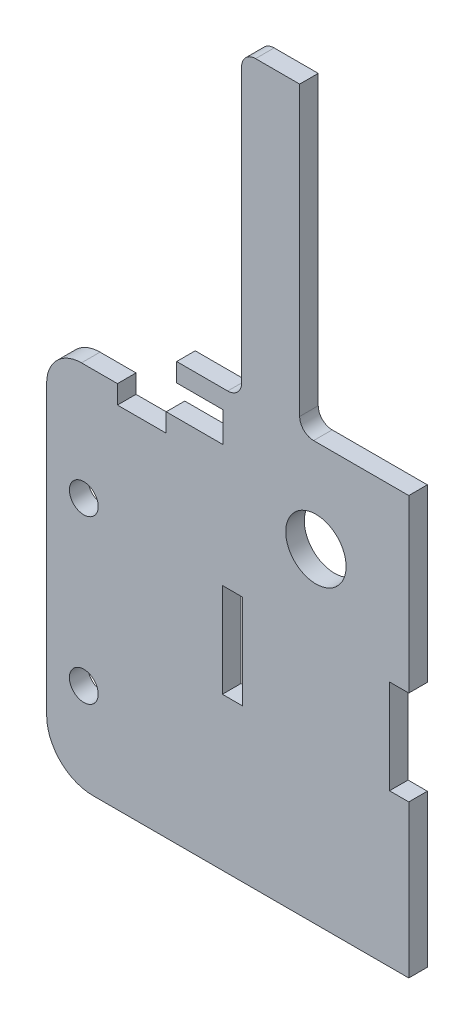
ISO-10303-21;
HEADER;
FILE_DESCRIPTION(('STEP AP214'),'2;1');
FILE_NAME('part.step','',(''),(''),'','','');
FILE_SCHEMA(('AUTOMOTIVE_DESIGN { 1 0 10303 214 1 1 1 1 }'));
ENDSEC;
DATA;
#1=APPLICATION_CONTEXT('core data for automotive mechanical design processes');
#2=APPLICATION_PROTOCOL_DEFINITION('international standard','automotive_design',2000,#1);
#3=PRODUCT_CONTEXT('',#1,'mechanical');
#4=PRODUCT('Part','Part','',(#3));
#5=PRODUCT_RELATED_PRODUCT_CATEGORY('part','',(#4));
#6=PRODUCT_DEFINITION_FORMATION('','',#4);
#7=PRODUCT_DEFINITION_CONTEXT('part definition',#1,'design');
#8=PRODUCT_DEFINITION('design','',#6,#7);
#9=PRODUCT_DEFINITION_SHAPE('','',#8);
#10=(LENGTH_UNIT() NAMED_UNIT(*) SI_UNIT(.MILLI.,.METRE.));
#11=(NAMED_UNIT(*) PLANE_ANGLE_UNIT() SI_UNIT($,.RADIAN.));
#12=(NAMED_UNIT(*) SI_UNIT($,.STERADIAN.) SOLID_ANGLE_UNIT());
#13=UNCERTAINTY_MEASURE_WITH_UNIT(LENGTH_MEASURE(1.E-05),#10,'distance_accuracy_value','');
#14=(GEOMETRIC_REPRESENTATION_CONTEXT(3) GLOBAL_UNCERTAINTY_ASSIGNED_CONTEXT((#13)) GLOBAL_UNIT_ASSIGNED_CONTEXT((#10,
#11,#12)) REPRESENTATION_CONTEXT('',''));
#15=CARTESIAN_POINT('',(0.,0.,0.));
#16=DIRECTION('',(0.,0.,1.));
#17=DIRECTION('',(1.,0.,0.));
#18=AXIS2_PLACEMENT_3D('',#15,#16,#17);
#19=CARTESIAN_POINT('',(3.99999999999999,4.5,40.));
#20=DIRECTION('',(-1.,0.,0.));
#21=DIRECTION('',(0.,-1.,0.));
#22=AXIS2_PLACEMENT_3D('',#19,#20,#21);
#23=PLANE('',#22);
#24=DIRECTION('',(0.,0.,1.));
#25=VECTOR('',#24,1.);
#26=CARTESIAN_POINT('',(3.99999999999999,66.5,40.));
#27=LINE('',#26,#25);
#28=CARTESIAN_POINT('',(3.99999999999999,66.5,36.));
#29=VERTEX_POINT('',#28);
#30=CARTESIAN_POINT('',(3.99999999999999,66.5,40.));
#31=VERTEX_POINT('',#30);
#32=EDGE_CURVE('E11',#29,#31,#27,.T.);
#33=ORIENTED_EDGE('',*,*,#32,.F.);
#34=DIRECTION('',(0.,1.,0.));
#35=VECTOR('',#34,1.);
#36=CARTESIAN_POINT('',(3.99999999999999,0.,36.));
#37=LINE('',#36,#35);
#38=CARTESIAN_POINT('',(3.99999999999999,7.5,36.));
#39=VERTEX_POINT('',#38);
#40=EDGE_CURVE('E178',#29,#39,#37,.F.);
#41=ORIENTED_EDGE('',*,*,#40,.T.);
#42=DIRECTION('',(0.,0.,1.));
#43=VECTOR('',#42,1.);
#44=CARTESIAN_POINT('',(3.99999999999999,7.5,40.));
#45=LINE('',#44,#43);
#46=CARTESIAN_POINT('',(3.99999999999999,7.5,40.));
#47=VERTEX_POINT('',#46);
#48=EDGE_CURVE('E55',#39,#47,#45,.T.);
#49=ORIENTED_EDGE('',*,*,#48,.T.);
#50=DIRECTION('',(0.,-1.,0.));
#51=VECTOR('',#50,1.);
#52=CARTESIAN_POINT('',(3.99999999999999,4.5,40.));
#53=LINE('',#52,#51);
#54=EDGE_CURVE('E371',#31,#47,#53,.T.);
#55=ORIENTED_EDGE('',*,*,#54,.F.);
#56=EDGE_LOOP('',(#33,#41,#49,#55));
#57=FACE_BOUND('',#56,.T.);
#58=ADVANCED_FACE('F45',(#57),#23,.T.);
#59=CARTESIAN_POINT('',(0.99999999999999,7.5,40.));
#60=DIRECTION('',(0.,0.,1.));
#61=DIRECTION('',(1.,0.,0.));
#62=AXIS2_PLACEMENT_3D('',#59,#60,#61);
#63=CYLINDRICAL_SURFACE('',#62,3.);
#64=ORIENTED_EDGE('',*,*,#48,.F.);
#65=CARTESIAN_POINT('',(0.99999999999999,7.5,36.));
#66=DIRECTION('',(0.,0.,1.));
#67=DIRECTION('',(1.,0.,0.));
#68=AXIS2_PLACEMENT_3D('',#65,#66,#67);
#69=CIRCLE('',#68,3.);
#70=CARTESIAN_POINT('',(0.99999999999999,4.5,36.));
#71=VERTEX_POINT('',#70);
#72=EDGE_CURVE('E278',#39,#71,#69,.F.);
#73=ORIENTED_EDGE('',*,*,#72,.T.);
#74=DIRECTION('',(0.,0.,1.));
#75=VECTOR('',#74,1.);
#76=CARTESIAN_POINT('',(0.99999999999999,4.5,40.));
#77=LINE('',#76,#75);
#78=CARTESIAN_POINT('',(0.99999999999999,4.5,40.));
#79=VERTEX_POINT('',#78);
#80=EDGE_CURVE('E364',#71,#79,#77,.T.);
#81=ORIENTED_EDGE('',*,*,#80,.T.);
#82=CARTESIAN_POINT('',(0.99999999999999,7.5,40.));
#83=DIRECTION('',(0.,0.,1.));
#84=DIRECTION('',(1.,0.,0.));
#85=AXIS2_PLACEMENT_3D('',#82,#83,#84);
#86=CIRCLE('',#85,3.);
#87=EDGE_CURVE('E381',#47,#79,#86,.F.);
#88=ORIENTED_EDGE('',*,*,#87,.F.);
#89=EDGE_LOOP('',(#64,#73,#81,#88));
#90=FACE_BOUND('',#89,.T.);
#91=ADVANCED_FACE('F385',(#90),#63,.F.);
#92=CARTESIAN_POINT('',(0.,4.5,40.));
#93=DIRECTION('',(0.,-1.,0.));
#94=DIRECTION('',(1.,0.,0.));
#95=AXIS2_PLACEMENT_3D('',#92,#93,#94);
#96=PLANE('',#95);
#97=ORIENTED_EDGE('',*,*,#80,.F.);
#98=DIRECTION('',(1.,0.,0.));
#99=VECTOR('',#98,1.);
#100=CARTESIAN_POINT('',(0.,4.5,36.));
#101=LINE('',#100,#99);
#102=CARTESIAN_POINT('',(-10.,4.5,36.));
#103=VERTEX_POINT('',#102);
#104=EDGE_CURVE('E274',#103,#71,#101,.T.);
#105=ORIENTED_EDGE('',*,*,#104,.F.);
#106=DIRECTION('',(0.,0.,1.));
#107=VECTOR('',#106,1.);
#108=CARTESIAN_POINT('',(-10.,4.5,40.));
#109=LINE('',#108,#107);
#110=CARTESIAN_POINT('',(-10.,4.5,40.));
#111=VERTEX_POINT('',#110);
#112=EDGE_CURVE('E361',#103,#111,#109,.T.);
#113=ORIENTED_EDGE('',*,*,#112,.T.);
#114=DIRECTION('',(1.,0.,0.));
#115=VECTOR('',#114,1.);
#116=CARTESIAN_POINT('',(0.,4.5,40.));
#117=LINE('',#116,#115);
#118=EDGE_CURVE('E387',#111,#79,#117,.T.);
#119=ORIENTED_EDGE('',*,*,#118,.T.);
#120=EDGE_LOOP('',(#97,#105,#113,#119));
#121=FACE_BOUND('',#120,.T.);
#122=ADVANCED_FACE('F608',(#121),#96,.F.);
#123=CARTESIAN_POINT('',(-10.,0.,40.));
#124=DIRECTION('',(1.,0.,0.));
#125=DIRECTION('',(0.,1.,0.));
#126=AXIS2_PLACEMENT_3D('',#123,#124,#125);
#127=PLANE('',#126);
#128=ORIENTED_EDGE('',*,*,#112,.F.);
#129=DIRECTION('',(0.,1.,0.));
#130=VECTOR('',#129,1.);
#131=CARTESIAN_POINT('',(-10.,0.,36.));
#132=LINE('',#131,#130);
#133=CARTESIAN_POINT('',(-10.,0.499999999999999,36.));
#134=VERTEX_POINT('',#133);
#135=EDGE_CURVE('E270',#134,#103,#132,.T.);
#136=ORIENTED_EDGE('',*,*,#135,.F.);
#137=DIRECTION('',(0.,0.,1.));
#138=VECTOR('',#137,1.);
#139=CARTESIAN_POINT('',(-10.,0.499999999999999,40.));
#140=LINE('',#139,#138);
#141=CARTESIAN_POINT('',(-10.,0.499999999999999,40.));
#142=VERTEX_POINT('',#141);
#143=EDGE_CURVE('E358',#134,#142,#140,.T.);
#144=ORIENTED_EDGE('',*,*,#143,.T.);
#145=DIRECTION('',(0.,1.,0.));
#146=VECTOR('',#145,1.);
#147=CARTESIAN_POINT('',(-10.,0.,40.));
#148=LINE('',#147,#146);
#149=EDGE_CURVE('E391',#142,#111,#148,.T.);
#150=ORIENTED_EDGE('',*,*,#149,.T.);
#151=EDGE_LOOP('',(#128,#136,#144,#150));
#152=FACE_BOUND('',#151,.T.);
#153=ADVANCED_FACE('F704',(#152),#127,.F.);
#154=CARTESIAN_POINT('',(0.,0.499999999999999,40.));
#155=DIRECTION('',(0.,-1.,0.));
#156=DIRECTION('',(1.,0.,0.));
#157=AXIS2_PLACEMENT_3D('',#154,#155,#156);
#158=PLANE('',#157);
#159=ORIENTED_EDGE('',*,*,#143,.F.);
#160=DIRECTION('',(1.,0.,0.));
#161=VECTOR('',#160,1.);
#162=CARTESIAN_POINT('',(0.,0.499999999999999,36.));
#163=LINE('',#162,#161);
#164=CARTESIAN_POINT('',(0.,0.499999999999999,36.));
#165=VERTEX_POINT('',#164);
#166=EDGE_CURVE('E266',#134,#165,#163,.T.);
#167=ORIENTED_EDGE('',*,*,#166,.T.);
#168=DIRECTION('',(0.,0.,1.));
#169=VECTOR('',#168,1.);
#170=CARTESIAN_POINT('',(0.,0.499999999999999,40.));
#171=LINE('',#170,#169);
#172=CARTESIAN_POINT('',(0.,0.499999999999999,40.));
#173=VERTEX_POINT('',#172);
#174=EDGE_CURVE('E355',#165,#173,#171,.T.);
#175=ORIENTED_EDGE('',*,*,#174,.T.);
#176=DIRECTION('',(1.,0.,0.));
#177=VECTOR('',#176,1.);
#178=CARTESIAN_POINT('',(0.,0.499999999999999,40.));
#179=LINE('',#178,#177);
#180=EDGE_CURVE('E399',#142,#173,#179,.T.);
#181=ORIENTED_EDGE('',*,*,#180,.F.);
#182=EDGE_LOOP('',(#159,#167,#175,#181));
#183=FACE_BOUND('',#182,.T.);
#184=ADVANCED_FACE('F715',(#183),#158,.T.);
#185=CARTESIAN_POINT('',(0.,0.,40.));
#186=DIRECTION('',(-1.,0.,0.));
#187=DIRECTION('',(0.,-1.,0.));
#188=AXIS2_PLACEMENT_3D('',#185,#186,#187);
#189=PLANE('',#188);
#190=ORIENTED_EDGE('',*,*,#174,.F.);
#191=DIRECTION('',(0.,1.,0.));
#192=VECTOR('',#191,1.);
#193=CARTESIAN_POINT('',(0.,0.,36.));
#194=LINE('',#193,#192);
#195=CARTESIAN_POINT('',(0.,-6.00000000000001,36.));
#196=VERTEX_POINT('',#195);
#197=EDGE_CURVE('E262',#165,#196,#194,.F.);
#198=ORIENTED_EDGE('',*,*,#197,.T.);
#199=DIRECTION('',(0.,0.,1.));
#200=VECTOR('',#199,1.);
#201=CARTESIAN_POINT('',(0.,-6.00000000000001,40.));
#202=LINE('',#201,#200);
#203=CARTESIAN_POINT('',(0.,-6.00000000000001,40.));
#204=VERTEX_POINT('',#203);
#205=EDGE_CURVE('E352',#196,#204,#202,.T.);
#206=ORIENTED_EDGE('',*,*,#205,.T.);
#207=DIRECTION('',(0.,-1.,0.));
#208=VECTOR('',#207,1.);
#209=CARTESIAN_POINT('',(0.,0.,40.));
#210=LINE('',#209,#208);
#211=EDGE_CURVE('E403',#173,#204,#210,.T.);
#212=ORIENTED_EDGE('',*,*,#211,.F.);
#213=EDGE_LOOP('',(#190,#198,#206,#212));
#214=FACE_BOUND('',#213,.T.);
#215=ADVANCED_FACE('F725',(#214),#189,.T.);
#216=CARTESIAN_POINT('',(0.,-6.00000000000001,40.));
#217=DIRECTION('',(0.,1.,0.));
#218=DIRECTION('',(-1.,0.,0.));
#219=AXIS2_PLACEMENT_3D('',#216,#217,#218);
#220=PLANE('',#219);
#221=ORIENTED_EDGE('',*,*,#205,.F.);
#222=DIRECTION('',(1.,0.,0.));
#223=VECTOR('',#222,1.);
#224=CARTESIAN_POINT('',(0.,-6.00000000000001,36.));
#225=LINE('',#224,#223);
#226=CARTESIAN_POINT('',(-12.25,-6.,36.));
#227=VERTEX_POINT('',#226);
#228=EDGE_CURVE('E258',#196,#227,#225,.F.);
#229=ORIENTED_EDGE('',*,*,#228,.T.);
#230=DIRECTION('',(0.,0.,1.));
#231=VECTOR('',#230,1.);
#232=CARTESIAN_POINT('',(-12.25,-6.,40.));
#233=LINE('',#232,#231);
#234=CARTESIAN_POINT('',(-12.25,-6.,40.));
#235=VERTEX_POINT('',#234);
#236=EDGE_CURVE('E349',#227,#235,#233,.T.);
#237=ORIENTED_EDGE('',*,*,#236,.T.);
#238=DIRECTION('',(-1.,0.,0.));
#239=VECTOR('',#238,1.);
#240=CARTESIAN_POINT('',(0.,-6.00000000000001,40.));
#241=LINE('',#240,#239);
#242=EDGE_CURVE('E407',#204,#235,#241,.T.);
#243=ORIENTED_EDGE('',*,*,#242,.F.);
#244=EDGE_LOOP('',(#221,#229,#237,#243));
#245=FACE_BOUND('',#244,.T.);
#246=ADVANCED_FACE('F736',(#245),#220,.T.);
#247=CARTESIAN_POINT('',(-12.25,-10.,40.));
#248=DIRECTION('',(-1.,0.,0.));
#249=DIRECTION('',(0.,-1.,0.));
#250=AXIS2_PLACEMENT_3D('',#247,#248,#249);
#251=PLANE('',#250);
#252=ORIENTED_EDGE('',*,*,#236,.F.);
#253=DIRECTION('',(0.,1.,0.));
#254=VECTOR('',#253,1.);
#255=CARTESIAN_POINT('',(-12.25,0.,36.));
#256=LINE('',#255,#254);
#257=CARTESIAN_POINT('',(-12.25,-10.,36.));
#258=VERTEX_POINT('',#257);
#259=EDGE_CURVE('E254',#227,#258,#256,.F.);
#260=ORIENTED_EDGE('',*,*,#259,.T.);
#261=DIRECTION('',(0.,0.,1.));
#262=VECTOR('',#261,1.);
#263=CARTESIAN_POINT('',(-12.25,-10.,40.));
#264=LINE('',#263,#262);
#265=CARTESIAN_POINT('',(-12.25,-10.,40.));
#266=VERTEX_POINT('',#265);
#267=EDGE_CURVE('E346',#258,#266,#264,.T.);
#268=ORIENTED_EDGE('',*,*,#267,.T.);
#269=DIRECTION('',(0.,-1.,0.));
#270=VECTOR('',#269,1.);
#271=CARTESIAN_POINT('',(-12.25,-10.,40.));
#272=LINE('',#271,#270);
#273=EDGE_CURVE('E411',#235,#266,#272,.T.);
#274=ORIENTED_EDGE('',*,*,#273,.F.);
#275=EDGE_LOOP('',(#252,#260,#268,#274));
#276=FACE_BOUND('',#275,.T.);
#277=ADVANCED_FACE('F747',(#276),#251,.T.);
#278=CARTESIAN_POINT('',(-12.25,-10.,40.));
#279=DIRECTION('',(0.,1.,0.));
#280=DIRECTION('',(-1.,0.,0.));
#281=AXIS2_PLACEMENT_3D('',#278,#279,#280);
#282=PLANE('',#281);
#283=ORIENTED_EDGE('',*,*,#267,.F.);
#284=DIRECTION('',(1.,0.,0.));
#285=VECTOR('',#284,1.);
#286=CARTESIAN_POINT('',(0.,-10.,36.));
#287=LINE('',#286,#285);
#288=CARTESIAN_POINT('',(-22.75,-10.,36.));
#289=VERTEX_POINT('',#288);
#290=EDGE_CURVE('E250',#258,#289,#287,.F.);
#291=ORIENTED_EDGE('',*,*,#290,.T.);
#292=DIRECTION('',(0.,0.,1.));
#293=VECTOR('',#292,1.);
#294=CARTESIAN_POINT('',(-22.75,-10.,40.));
#295=LINE('',#294,#293);
#296=CARTESIAN_POINT('',(-22.75,-10.,40.));
#297=VERTEX_POINT('',#296);
#298=EDGE_CURVE('E343',#289,#297,#295,.T.);
#299=ORIENTED_EDGE('',*,*,#298,.T.);
#300=DIRECTION('',(-1.,0.,0.));
#301=VECTOR('',#300,1.);
#302=CARTESIAN_POINT('',(-12.25,-10.,40.));
#303=LINE('',#302,#301);
#304=EDGE_CURVE('E416',#266,#297,#303,.T.);
#305=ORIENTED_EDGE('',*,*,#304,.F.);
#306=EDGE_LOOP('',(#283,#291,#299,#305));
#307=FACE_BOUND('',#306,.T.);
#308=ADVANCED_FACE('F759',(#307),#282,.T.);
#309=CARTESIAN_POINT('',(-22.75,-10.,40.));
#310=DIRECTION('',(1.,0.,0.));
#311=DIRECTION('',(0.,1.,0.));
#312=AXIS2_PLACEMENT_3D('',#309,#310,#311);
#313=PLANE('',#312);
#314=ORIENTED_EDGE('',*,*,#298,.F.);
#315=DIRECTION('',(0.,1.,0.));
#316=VECTOR('',#315,1.);
#317=CARTESIAN_POINT('',(-22.75,0.,36.));
#318=LINE('',#317,#316);
#319=CARTESIAN_POINT('',(-22.75,-6.,36.));
#320=VERTEX_POINT('',#319);
#321=EDGE_CURVE('E246',#289,#320,#318,.T.);
#322=ORIENTED_EDGE('',*,*,#321,.T.);
#323=DIRECTION('',(0.,0.,1.));
#324=VECTOR('',#323,1.);
#325=CARTESIAN_POINT('',(-22.75,-6.,40.));
#326=LINE('',#325,#324);
#327=CARTESIAN_POINT('',(-22.75,-6.,40.));
#328=VERTEX_POINT('',#327);
#329=EDGE_CURVE('E340',#320,#328,#326,.T.);
#330=ORIENTED_EDGE('',*,*,#329,.T.);
#331=DIRECTION('',(0.,1.,0.));
#332=VECTOR('',#331,1.);
#333=CARTESIAN_POINT('',(-22.75,-10.,40.));
#334=LINE('',#333,#332);
#335=EDGE_CURVE('E420',#297,#328,#334,.T.);
#336=ORIENTED_EDGE('',*,*,#335,.F.);
#337=EDGE_LOOP('',(#314,#322,#330,#336));
#338=FACE_BOUND('',#337,.T.);
#339=ADVANCED_FACE('F770',(#338),#313,.T.);
#340=ORIENTED_EDGE('',*,*,#329,.F.);
#341=DIRECTION('',(1.,0.,0.));
#342=VECTOR('',#341,1.);
#343=CARTESIAN_POINT('',(0.,-6.,36.));
#344=LINE('',#343,#342);
#345=CARTESIAN_POINT('',(-30.5,-6.,36.));
#346=VERTEX_POINT('',#345);
#347=EDGE_CURVE('E242',#320,#346,#344,.F.);
#348=ORIENTED_EDGE('',*,*,#347,.T.);
#349=DIRECTION('',(0.,0.,1.));
#350=VECTOR('',#349,1.);
#351=CARTESIAN_POINT('',(-30.5,-6.,40.));
#352=LINE('',#351,#350);
#353=CARTESIAN_POINT('',(-30.5,-6.,40.));
#354=VERTEX_POINT('',#353);
#355=EDGE_CURVE('E337',#346,#354,#352,.T.);
#356=ORIENTED_EDGE('',*,*,#355,.T.);
#357=EDGE_CURVE('E412',#328,#354,#241,.T.);
#358=ORIENTED_EDGE('',*,*,#357,.F.);
#359=EDGE_LOOP('',(#340,#348,#356,#358));
#360=FACE_BOUND('',#359,.T.);
#361=ADVANCED_FACE('F750',(#360),#220,.T.);
#362=CARTESIAN_POINT('',(-30.5,-13.5,40.));
#363=DIRECTION('',(0.,0.,1.));
#364=DIRECTION('',(1.,0.,0.));
#365=AXIS2_PLACEMENT_3D('',#362,#363,#364);
#366=CYLINDRICAL_SURFACE('',#365,7.5);
#367=ORIENTED_EDGE('',*,*,#355,.F.);
#368=CARTESIAN_POINT('',(-30.5,-13.5,36.));
#369=DIRECTION('',(0.,0.,1.));
#370=DIRECTION('',(1.,0.,0.));
#371=AXIS2_PLACEMENT_3D('',#368,#369,#370);
#372=CIRCLE('',#371,7.5);
#373=CARTESIAN_POINT('',(-38.,-13.5,36.));
#374=VERTEX_POINT('',#373);
#375=EDGE_CURVE('E238',#346,#374,#372,.T.);
#376=ORIENTED_EDGE('',*,*,#375,.T.);
#377=DIRECTION('',(0.,0.,1.));
#378=VECTOR('',#377,1.);
#379=CARTESIAN_POINT('',(-38.,-13.5,40.));
#380=LINE('',#379,#378);
#381=CARTESIAN_POINT('',(-38.,-13.5,40.));
#382=VERTEX_POINT('',#381);
#383=EDGE_CURVE('E334',#374,#382,#380,.T.);
#384=ORIENTED_EDGE('',*,*,#383,.T.);
#385=CARTESIAN_POINT('',(-30.5,-13.5,40.));
#386=DIRECTION('',(0.,0.,1.));
#387=DIRECTION('',(1.,0.,0.));
#388=AXIS2_PLACEMENT_3D('',#385,#386,#387);
#389=CIRCLE('',#388,7.5);
#390=EDGE_CURVE('E424',#354,#382,#389,.T.);
#391=ORIENTED_EDGE('',*,*,#390,.F.);
#392=EDGE_LOOP('',(#367,#376,#384,#391));
#393=FACE_BOUND('',#392,.T.);
#394=ADVANCED_FACE('F791',(#393),#366,.T.);
#395=CARTESIAN_POINT('',(-38.,0.,40.));
#396=DIRECTION('',(-1.,0.,0.));
#397=DIRECTION('',(0.,-1.,0.));
#398=AXIS2_PLACEMENT_3D('',#395,#396,#397);
#399=PLANE('',#398);
#400=ORIENTED_EDGE('',*,*,#383,.F.);
#401=DIRECTION('',(0.,1.,0.));
#402=VECTOR('',#401,1.);
#403=CARTESIAN_POINT('',(-38.,0.,36.));
#404=LINE('',#403,#402);
#405=CARTESIAN_POINT('',(-38.,-75.5,36.));
#406=VERTEX_POINT('',#405);
#407=EDGE_CURVE('E234',#374,#406,#404,.F.);
#408=ORIENTED_EDGE('',*,*,#407,.T.);
#409=DIRECTION('',(0.,0.,1.));
#410=VECTOR('',#409,1.);
#411=CARTESIAN_POINT('',(-38.,-75.5,40.));
#412=LINE('',#411,#410);
#413=CARTESIAN_POINT('',(-38.,-75.5,40.));
#414=VERTEX_POINT('',#413);
#415=EDGE_CURVE('E331',#406,#414,#412,.T.);
#416=ORIENTED_EDGE('',*,*,#415,.T.);
#417=DIRECTION('',(0.,-1.,0.));
#418=VECTOR('',#417,1.);
#419=CARTESIAN_POINT('',(-38.,0.,40.));
#420=LINE('',#419,#418);
#421=EDGE_CURVE('E428',#382,#414,#420,.T.);
#422=ORIENTED_EDGE('',*,*,#421,.F.);
#423=EDGE_LOOP('',(#400,#408,#416,#422));
#424=FACE_BOUND('',#423,.T.);
#425=ADVANCED_FACE('F801',(#424),#399,.T.);
#426=CARTESIAN_POINT('',(-28.,-75.5,40.));
#427=DIRECTION('',(0.,0.,1.));
#428=DIRECTION('',(1.,0.,0.));
#429=AXIS2_PLACEMENT_3D('',#426,#427,#428);
#430=CYLINDRICAL_SURFACE('',#429,10.);
#431=ORIENTED_EDGE('',*,*,#415,.F.);
#432=CARTESIAN_POINT('',(-28.,-75.5,36.));
#433=DIRECTION('',(0.,0.,1.));
#434=DIRECTION('',(1.,0.,0.));
#435=AXIS2_PLACEMENT_3D('',#432,#433,#434);
#436=CIRCLE('',#435,10.);
#437=CARTESIAN_POINT('',(-28.,-85.5,36.));
#438=VERTEX_POINT('',#437);
#439=EDGE_CURVE('E230',#406,#438,#436,.T.);
#440=ORIENTED_EDGE('',*,*,#439,.T.);
#441=DIRECTION('',(0.,0.,1.));
#442=VECTOR('',#441,1.);
#443=CARTESIAN_POINT('',(-28.,-85.5,40.));
#444=LINE('',#443,#442);
#445=CARTESIAN_POINT('',(-28.,-85.5,40.));
#446=VERTEX_POINT('',#445);
#447=EDGE_CURVE('E328',#438,#446,#444,.T.);
#448=ORIENTED_EDGE('',*,*,#447,.T.);
#449=CARTESIAN_POINT('',(-28.,-75.5,40.));
#450=DIRECTION('',(0.,0.,1.));
#451=DIRECTION('',(1.,0.,0.));
#452=AXIS2_PLACEMENT_3D('',#449,#450,#451);
#453=CIRCLE('',#452,10.);
#454=EDGE_CURVE('E432',#414,#446,#453,.T.);
#455=ORIENTED_EDGE('',*,*,#454,.F.);
#456=EDGE_LOOP('',(#431,#440,#448,#455));
#457=FACE_BOUND('',#456,.T.);
#458=ADVANCED_FACE('F812',(#457),#430,.T.);
#459=CARTESIAN_POINT('',(0.,-85.5,40.));
#460=DIRECTION('',(0.,1.,0.));
#461=DIRECTION('',(-1.,0.,0.));
#462=AXIS2_PLACEMENT_3D('',#459,#460,#461);
#463=PLANE('',#462);
#464=ORIENTED_EDGE('',*,*,#447,.F.);
#465=DIRECTION('',(1.,0.,0.));
#466=VECTOR('',#465,1.);
#467=CARTESIAN_POINT('',(0.,-85.5,36.));
#468=LINE('',#467,#466);
#469=CARTESIAN_POINT('',(40.,-85.5,36.));
#470=VERTEX_POINT('',#469);
#471=EDGE_CURVE('E226',#470,#438,#468,.F.);
#472=ORIENTED_EDGE('',*,*,#471,.F.);
#473=DIRECTION('',(0.,0.,1.));
#474=VECTOR('',#473,1.);
#475=CARTESIAN_POINT('',(40.,-85.5,40.));
#476=LINE('',#475,#474);
#477=CARTESIAN_POINT('',(40.,-85.5,40.));
#478=VERTEX_POINT('',#477);
#479=EDGE_CURVE('E325',#470,#478,#476,.T.);
#480=ORIENTED_EDGE('',*,*,#479,.T.);
#481=DIRECTION('',(-1.,0.,0.));
#482=VECTOR('',#481,1.);
#483=CARTESIAN_POINT('',(0.,-85.5,40.));
#484=LINE('',#483,#482);
#485=EDGE_CURVE('E436',#478,#446,#484,.T.);
#486=ORIENTED_EDGE('',*,*,#485,.T.);
#487=EDGE_LOOP('',(#464,#472,#480,#486));
#488=FACE_BOUND('',#487,.T.);
#489=ADVANCED_FACE('F823',(#488),#463,.F.);
#490=CARTESIAN_POINT('',(40.,0.,40.));
#491=DIRECTION('',(-1.,0.,0.));
#492=DIRECTION('',(0.,-1.,0.));
#493=AXIS2_PLACEMENT_3D('',#490,#491,#492);
#494=PLANE('',#493);
#495=ORIENTED_EDGE('',*,*,#479,.F.);
#496=DIRECTION('',(0.,1.,0.));
#497=VECTOR('',#496,1.);
#498=CARTESIAN_POINT('',(40.,0.,36.));
#499=LINE('',#498,#497);
#500=CARTESIAN_POINT('',(40.,-52.65,36.));
#501=VERTEX_POINT('',#500);
#502=EDGE_CURVE('E222',#501,#470,#499,.F.);
#503=ORIENTED_EDGE('',*,*,#502,.F.);
#504=DIRECTION('',(0.,0.,1.));
#505=VECTOR('',#504,1.);
#506=CARTESIAN_POINT('',(40.,-52.65,40.));
#507=LINE('',#506,#505);
#508=CARTESIAN_POINT('',(40.,-52.65,40.));
#509=VERTEX_POINT('',#508);
#510=EDGE_CURVE('E322',#501,#509,#507,.T.);
#511=ORIENTED_EDGE('',*,*,#510,.T.);
#512=DIRECTION('',(0.,-1.,0.));
#513=VECTOR('',#512,1.);
#514=CARTESIAN_POINT('',(40.,0.,40.));
#515=LINE('',#514,#513);
#516=EDGE_CURVE('E440',#509,#478,#515,.T.);
#517=ORIENTED_EDGE('',*,*,#516,.T.);
#518=EDGE_LOOP('',(#495,#503,#511,#517));
#519=FACE_BOUND('',#518,.T.);
#520=ADVANCED_FACE('F834',(#519),#494,.F.);
#521=CARTESIAN_POINT('',(35.85,-52.65,40.));
#522=DIRECTION('',(0.,1.,0.));
#523=DIRECTION('',(-1.,0.,0.));
#524=AXIS2_PLACEMENT_3D('',#521,#522,#523);
#525=PLANE('',#524);
#526=ORIENTED_EDGE('',*,*,#510,.F.);
#527=DIRECTION('',(1.,0.,0.));
#528=VECTOR('',#527,1.);
#529=CARTESIAN_POINT('',(0.,-52.65,36.));
#530=LINE('',#529,#528);
#531=CARTESIAN_POINT('',(35.85,-52.65,36.));
#532=VERTEX_POINT('',#531);
#533=EDGE_CURVE('E218',#501,#532,#530,.F.);
#534=ORIENTED_EDGE('',*,*,#533,.T.);
#535=DIRECTION('',(0.,0.,1.));
#536=VECTOR('',#535,1.);
#537=CARTESIAN_POINT('',(35.85,-52.65,40.));
#538=LINE('',#537,#536);
#539=CARTESIAN_POINT('',(35.85,-52.65,40.));
#540=VERTEX_POINT('',#539);
#541=EDGE_CURVE('E319',#532,#540,#538,.T.);
#542=ORIENTED_EDGE('',*,*,#541,.T.);
#543=DIRECTION('',(-1.,0.,0.));
#544=VECTOR('',#543,1.);
#545=CARTESIAN_POINT('',(35.85,-52.65,40.));
#546=LINE('',#545,#544);
#547=EDGE_CURVE('E444',#509,#540,#546,.T.);
#548=ORIENTED_EDGE('',*,*,#547,.F.);
#549=EDGE_LOOP('',(#526,#534,#542,#548));
#550=FACE_BOUND('',#549,.T.);
#551=ADVANCED_FACE('F845',(#550),#525,.T.);
#552=CARTESIAN_POINT('',(35.85,-32.35,40.));
#553=DIRECTION('',(1.,0.,0.));
#554=DIRECTION('',(0.,1.,0.));
#555=AXIS2_PLACEMENT_3D('',#552,#553,#554);
#556=PLANE('',#555);
#557=ORIENTED_EDGE('',*,*,#541,.F.);
#558=DIRECTION('',(0.,1.,0.));
#559=VECTOR('',#558,1.);
#560=CARTESIAN_POINT('',(35.85,0.,36.));
#561=LINE('',#560,#559);
#562=CARTESIAN_POINT('',(35.85,-32.35,36.));
#563=VERTEX_POINT('',#562);
#564=EDGE_CURVE('E214',#532,#563,#561,.T.);
#565=ORIENTED_EDGE('',*,*,#564,.T.);
#566=DIRECTION('',(0.,0.,1.));
#567=VECTOR('',#566,1.);
#568=CARTESIAN_POINT('',(35.85,-32.35,40.));
#569=LINE('',#568,#567);
#570=CARTESIAN_POINT('',(35.85,-32.35,40.));
#571=VERTEX_POINT('',#570);
#572=EDGE_CURVE('E316',#563,#571,#569,.T.);
#573=ORIENTED_EDGE('',*,*,#572,.T.);
#574=DIRECTION('',(0.,1.,0.));
#575=VECTOR('',#574,1.);
#576=CARTESIAN_POINT('',(35.85,-32.35,40.));
#577=LINE('',#576,#575);
#578=EDGE_CURVE('E449',#540,#571,#577,.T.);
#579=ORIENTED_EDGE('',*,*,#578,.F.);
#580=EDGE_LOOP('',(#557,#565,#573,#579));
#581=FACE_BOUND('',#580,.T.);
#582=ADVANCED_FACE('F857',(#581),#556,.T.);
#583=CARTESIAN_POINT('',(35.85,-32.35,40.));
#584=DIRECTION('',(0.,-1.,0.));
#585=DIRECTION('',(1.,0.,0.));
#586=AXIS2_PLACEMENT_3D('',#583,#584,#585);
#587=PLANE('',#586);
#588=ORIENTED_EDGE('',*,*,#572,.F.);
#589=DIRECTION('',(1.,0.,0.));
#590=VECTOR('',#589,1.);
#591=CARTESIAN_POINT('',(0.,-32.35,36.));
#592=LINE('',#591,#590);
#593=CARTESIAN_POINT('',(40.,-32.35,36.));
#594=VERTEX_POINT('',#593);
#595=EDGE_CURVE('E210',#563,#594,#592,.T.);
#596=ORIENTED_EDGE('',*,*,#595,.T.);
#597=DIRECTION('',(0.,0.,1.));
#598=VECTOR('',#597,1.);
#599=CARTESIAN_POINT('',(40.,-32.35,40.));
#600=LINE('',#599,#598);
#601=CARTESIAN_POINT('',(40.,-32.35,40.));
#602=VERTEX_POINT('',#601);
#603=EDGE_CURVE('E313',#594,#602,#600,.T.);
#604=ORIENTED_EDGE('',*,*,#603,.T.);
#605=DIRECTION('',(1.,0.,0.));
#606=VECTOR('',#605,1.);
#607=CARTESIAN_POINT('',(35.85,-32.35,40.));
#608=LINE('',#607,#606);
#609=EDGE_CURVE('E453',#571,#602,#608,.T.);
#610=ORIENTED_EDGE('',*,*,#609,.F.);
#611=EDGE_LOOP('',(#588,#596,#604,#610));
#612=FACE_BOUND('',#611,.T.);
#613=ADVANCED_FACE('F868',(#612),#587,.T.);
#614=ORIENTED_EDGE('',*,*,#603,.F.);
#615=DIRECTION('',(0.,1.,0.));
#616=VECTOR('',#615,1.);
#617=CARTESIAN_POINT('',(40.,0.,36.));
#618=LINE('',#617,#616);
#619=CARTESIAN_POINT('',(40.,4.5,36.));
#620=VERTEX_POINT('',#619);
#621=EDGE_CURVE('E206',#620,#594,#618,.F.);
#622=ORIENTED_EDGE('',*,*,#621,.F.);
#623=DIRECTION('',(0.,0.,1.));
#624=VECTOR('',#623,1.);
#625=CARTESIAN_POINT('',(40.,4.5,40.));
#626=LINE('',#625,#624);
#627=CARTESIAN_POINT('',(40.,4.5,40.));
#628=VERTEX_POINT('',#627);
#629=EDGE_CURVE('E310',#620,#628,#626,.T.);
#630=ORIENTED_EDGE('',*,*,#629,.T.);
#631=EDGE_CURVE('E445',#628,#602,#515,.T.);
#632=ORIENTED_EDGE('',*,*,#631,.T.);
#633=EDGE_LOOP('',(#614,#622,#630,#632));
#634=FACE_BOUND('',#633,.T.);
#635=ADVANCED_FACE('F848',(#634),#494,.F.);
#636=ORIENTED_EDGE('',*,*,#629,.F.);
#637=DIRECTION('',(1.,0.,0.));
#638=VECTOR('',#637,1.);
#639=CARTESIAN_POINT('',(0.,4.5,36.));
#640=LINE('',#639,#638);
#641=CARTESIAN_POINT('',(19.5,4.5,36.));
#642=VERTEX_POINT('',#641);
#643=EDGE_CURVE('E202',#642,#620,#640,.T.);
#644=ORIENTED_EDGE('',*,*,#643,.F.);
#645=DIRECTION('',(0.,0.,1.));
#646=VECTOR('',#645,1.);
#647=CARTESIAN_POINT('',(19.5,4.5,40.));
#648=LINE('',#647,#646);
#649=CARTESIAN_POINT('',(19.5,4.5,40.));
#650=VERTEX_POINT('',#649);
#651=EDGE_CURVE('E307',#642,#650,#648,.T.);
#652=ORIENTED_EDGE('',*,*,#651,.T.);
#653=EDGE_CURVE('E393',#650,#628,#117,.T.);
#654=ORIENTED_EDGE('',*,*,#653,.T.);
#655=EDGE_LOOP('',(#636,#644,#652,#654));
#656=FACE_BOUND('',#655,.T.);
#657=ADVANCED_FACE('F554',(#656),#96,.F.);
#658=CARTESIAN_POINT('',(19.5,7.5,40.));
#659=DIRECTION('',(0.,0.,1.));
#660=DIRECTION('',(1.,0.,0.));
#661=AXIS2_PLACEMENT_3D('',#658,#659,#660);
#662=CYLINDRICAL_SURFACE('',#661,3.);
#663=ORIENTED_EDGE('',*,*,#651,.F.);
#664=CARTESIAN_POINT('',(19.5,7.5,36.));
#665=DIRECTION('',(0.,0.,1.));
#666=DIRECTION('',(1.,0.,0.));
#667=AXIS2_PLACEMENT_3D('',#664,#665,#666);
#668=CIRCLE('',#667,3.);
#669=CARTESIAN_POINT('',(16.5,7.5,36.));
#670=VERTEX_POINT('',#669);
#671=EDGE_CURVE('E198',#642,#670,#668,.F.);
#672=ORIENTED_EDGE('',*,*,#671,.T.);
#673=DIRECTION('',(0.,0.,1.));
#674=VECTOR('',#673,1.);
#675=CARTESIAN_POINT('',(16.5,7.5,40.));
#676=LINE('',#675,#674);
#677=CARTESIAN_POINT('',(16.5,7.5,40.));
#678=VERTEX_POINT('',#677);
#679=EDGE_CURVE('E305',#670,#678,#676,.T.);
#680=ORIENTED_EDGE('',*,*,#679,.T.);
#681=CARTESIAN_POINT('',(19.5,7.5,40.));
#682=DIRECTION('',(0.,0.,1.));
#683=DIRECTION('',(1.,0.,0.));
#684=AXIS2_PLACEMENT_3D('',#681,#682,#683);
#685=CIRCLE('',#684,3.);
#686=EDGE_CURVE('E457',#650,#678,#685,.F.);
#687=ORIENTED_EDGE('',*,*,#686,.F.);
#688=EDGE_LOOP('',(#663,#672,#680,#687));
#689=FACE_BOUND('',#688,.T.);
#690=ADVANCED_FACE('F561',(#689),#662,.F.);
#691=CARTESIAN_POINT('',(16.5,4.5,40.));
#692=DIRECTION('',(1.,0.,0.));
#693=DIRECTION('',(0.,1.,0.));
#694=AXIS2_PLACEMENT_3D('',#691,#692,#693);
#695=PLANE('',#694);
#696=ORIENTED_EDGE('',*,*,#679,.F.);
#697=DIRECTION('',(0.,1.,0.));
#698=VECTOR('',#697,1.);
#699=CARTESIAN_POINT('',(16.5,0.,36.));
#700=LINE('',#699,#698);
#701=CARTESIAN_POINT('',(16.5,69.5,36.));
#702=VERTEX_POINT('',#701);
#703=EDGE_CURVE('E194',#670,#702,#700,.T.);
#704=ORIENTED_EDGE('',*,*,#703,.T.);
#705=DIRECTION('',(0.,0.,1.));
#706=VECTOR('',#705,1.);
#707=CARTESIAN_POINT('',(16.5,69.5,40.));
#708=LINE('',#707,#706);
#709=CARTESIAN_POINT('',(16.5,69.5,40.));
#710=VERTEX_POINT('',#709);
#711=EDGE_CURVE('E63',#702,#710,#708,.T.);
#712=ORIENTED_EDGE('',*,*,#711,.T.);
#713=DIRECTION('',(0.,1.,0.));
#714=VECTOR('',#713,1.);
#715=CARTESIAN_POINT('',(16.5,4.5,40.));
#716=LINE('',#715,#714);
#717=EDGE_CURVE('E461',#678,#710,#716,.T.);
#718=ORIENTED_EDGE('',*,*,#717,.F.);
#719=EDGE_LOOP('',(#696,#704,#712,#718));
#720=FACE_BOUND('',#719,.T.);
#721=ADVANCED_FACE('F562',(#720),#695,.T.);
#722=CARTESIAN_POINT('',(3.99999999999999,69.5,40.));
#723=DIRECTION('',(0.,1.,0.));
#724=DIRECTION('',(-1.,0.,0.));
#725=AXIS2_PLACEMENT_3D('',#722,#723,#724);
#726=PLANE('',#725);
#727=ORIENTED_EDGE('',*,*,#711,.F.);
#728=DIRECTION('',(1.,0.,0.));
#729=VECTOR('',#728,1.);
#730=CARTESIAN_POINT('',(0.,69.5,36.));
#731=LINE('',#730,#729);
#732=CARTESIAN_POINT('',(6.99999999999999,69.5,36.));
#733=VERTEX_POINT('',#732);
#734=EDGE_CURVE('E176',#702,#733,#731,.F.);
#735=ORIENTED_EDGE('',*,*,#734,.T.);
#736=DIRECTION('',(0.,0.,1.));
#737=VECTOR('',#736,1.);
#738=CARTESIAN_POINT('',(6.99999999999999,69.5,40.));
#739=LINE('',#738,#737);
#740=CARTESIAN_POINT('',(6.99999999999999,69.5,40.));
#741=VERTEX_POINT('',#740);
#742=EDGE_CURVE('E49',#733,#741,#739,.T.);
#743=ORIENTED_EDGE('',*,*,#742,.T.);
#744=DIRECTION('',(-1.,0.,0.));
#745=VECTOR('',#744,1.);
#746=CARTESIAN_POINT('',(3.99999999999999,69.5,40.));
#747=LINE('',#746,#745);
#748=EDGE_CURVE('E563',#710,#741,#747,.T.);
#749=ORIENTED_EDGE('',*,*,#748,.F.);
#750=EDGE_LOOP('',(#727,#735,#743,#749));
#751=FACE_BOUND('',#750,.T.);
#752=ADVANCED_FACE('F181',(#751),#726,.T.);
#753=CARTESIAN_POINT('',(-0.15,-32.35,40.));
#754=DIRECTION('',(1.,0.,0.));
#755=DIRECTION('',(0.,1.,0.));
#756=AXIS2_PLACEMENT_3D('',#753,#754,#755);
#757=PLANE('',#756);
#758=DIRECTION('',(0.,0.,1.));
#759=VECTOR('',#758,1.);
#760=CARTESIAN_POINT('',(-0.150000000000003,-52.65,40.));
#761=LINE('',#760,#759);
#762=CARTESIAN_POINT('',(-0.150000000000003,-52.65,36.));
#763=VERTEX_POINT('',#762);
#764=CARTESIAN_POINT('',(-0.150000000000003,-52.65,40.));
#765=VERTEX_POINT('',#764);
#766=EDGE_CURVE('E170',#763,#765,#761,.T.);
#767=ORIENTED_EDGE('',*,*,#766,.F.);
#768=DIRECTION('',(0.,1.,0.));
#769=VECTOR('',#768,1.);
#770=CARTESIAN_POINT('',(-0.150000000000003,0.,36.));
#771=LINE('',#770,#769);
#772=CARTESIAN_POINT('',(-0.15,-32.35,36.));
#773=VERTEX_POINT('',#772);
#774=EDGE_CURVE('E188',#763,#773,#771,.T.);
#775=ORIENTED_EDGE('',*,*,#774,.T.);
#776=DIRECTION('',(0.,0.,1.));
#777=VECTOR('',#776,1.);
#778=CARTESIAN_POINT('',(-0.15,-32.35,40.));
#779=LINE('',#778,#777);
#780=CARTESIAN_POINT('',(-0.15,-32.35,40.));
#781=VERTEX_POINT('',#780);
#782=EDGE_CURVE('E295',#773,#781,#779,.T.);
#783=ORIENTED_EDGE('',*,*,#782,.T.);
#784=DIRECTION('',(0.,1.,0.));
#785=VECTOR('',#784,1.);
#786=CARTESIAN_POINT('',(-0.15,-32.35,40.));
#787=LINE('',#786,#785);
#788=EDGE_CURVE('E569',#765,#781,#787,.T.);
#789=ORIENTED_EDGE('',*,*,#788,.F.);
#790=EDGE_LOOP('',(#767,#775,#783,#789));
#791=FACE_BOUND('',#790,.T.);
#792=ADVANCED_FACE('F593',(#791),#757,.T.);
#793=CARTESIAN_POINT('',(4.15,-32.35,40.));
#794=DIRECTION('',(0.,-1.,0.));
#795=DIRECTION('',(1.,0.,0.));
#796=AXIS2_PLACEMENT_3D('',#793,#794,#795);
#797=PLANE('',#796);
#798=ORIENTED_EDGE('',*,*,#782,.F.);
#799=DIRECTION('',(1.,0.,0.));
#800=VECTOR('',#799,1.);
#801=CARTESIAN_POINT('',(0.,-32.35,36.));
#802=LINE('',#801,#800);
#803=CARTESIAN_POINT('',(4.15,-32.35,36.));
#804=VERTEX_POINT('',#803);
#805=EDGE_CURVE('E183',#773,#804,#802,.T.);
#806=ORIENTED_EDGE('',*,*,#805,.T.);
#807=DIRECTION('',(0.,0.,1.));
#808=VECTOR('',#807,1.);
#809=CARTESIAN_POINT('',(4.15,-32.35,40.));
#810=LINE('',#809,#808);
#811=CARTESIAN_POINT('',(4.15,-32.35,40.));
#812=VERTEX_POINT('',#811);
#813=EDGE_CURVE('E292',#804,#812,#810,.T.);
#814=ORIENTED_EDGE('',*,*,#813,.T.);
#815=DIRECTION('',(1.,0.,0.));
#816=VECTOR('',#815,1.);
#817=CARTESIAN_POINT('',(4.15,-32.35,40.));
#818=LINE('',#817,#816);
#819=EDGE_CURVE('E507',#781,#812,#818,.T.);
#820=ORIENTED_EDGE('',*,*,#819,.F.);
#821=EDGE_LOOP('',(#798,#806,#814,#820));
#822=FACE_BOUND('',#821,.T.);
#823=ADVANCED_FACE('F505',(#822),#797,.T.);
#824=CARTESIAN_POINT('',(4.15,-32.35,40.));
#825=DIRECTION('',(-1.,0.,0.));
#826=DIRECTION('',(0.,-1.,0.));
#827=AXIS2_PLACEMENT_3D('',#824,#825,#826);
#828=PLANE('',#827);
#829=ORIENTED_EDGE('',*,*,#813,.F.);
#830=DIRECTION('',(0.,1.,0.));
#831=VECTOR('',#830,1.);
#832=CARTESIAN_POINT('',(4.15,0.,36.));
#833=LINE('',#832,#831);
#834=CARTESIAN_POINT('',(4.15,-52.65,36.));
#835=VERTEX_POINT('',#834);
#836=EDGE_CURVE('E476',#804,#835,#833,.F.);
#837=ORIENTED_EDGE('',*,*,#836,.T.);
#838=DIRECTION('',(0.,0.,1.));
#839=VECTOR('',#838,1.);
#840=CARTESIAN_POINT('',(4.15,-52.65,40.));
#841=LINE('',#840,#839);
#842=CARTESIAN_POINT('',(4.15,-52.65,40.));
#843=VERTEX_POINT('',#842);
#844=EDGE_CURVE('E296',#835,#843,#841,.T.);
#845=ORIENTED_EDGE('',*,*,#844,.T.);
#846=DIRECTION('',(0.,-1.,0.));
#847=VECTOR('',#846,1.);
#848=CARTESIAN_POINT('',(4.15,-32.35,40.));
#849=LINE('',#848,#847);
#850=EDGE_CURVE('E501',#812,#843,#849,.T.);
#851=ORIENTED_EDGE('',*,*,#850,.F.);
#852=EDGE_LOOP('',(#829,#837,#845,#851));
#853=FACE_BOUND('',#852,.T.);
#854=ADVANCED_FACE('F497',(#853),#828,.T.);
#855=CARTESIAN_POINT('',(20.,-15.5,40.));
#856=DIRECTION('',(0.,0.,1.));
#857=DIRECTION('',(1.,0.,0.));
#858=AXIS2_PLACEMENT_3D('',#855,#856,#857);
#859=CYLINDRICAL_SURFACE('',#858,6.50000000000001);
#860=CARTESIAN_POINT('',(20.,-15.5,40.));
#861=DIRECTION('',(0.,0.,1.));
#862=DIRECTION('',(1.,0.,0.));
#863=AXIS2_PLACEMENT_3D('',#860,#861,#862);
#864=CIRCLE('',#863,6.50000000000001);
#865=CARTESIAN_POINT('',(26.5,-15.5,40.));
#866=VERTEX_POINT('',#865);
#867=EDGE_CURVE('E291',#866,#866,#864,.T.);
#868=ORIENTED_EDGE('',*,*,#867,.T.);
#869=EDGE_LOOP('',(#868));
#870=FACE_BOUND('',#869,.T.);
#871=CARTESIAN_POINT('',(20.,-15.5,36.));
#872=DIRECTION('',(0.,0.,1.));
#873=DIRECTION('',(1.,0.,0.));
#874=AXIS2_PLACEMENT_3D('',#871,#872,#873);
#875=CIRCLE('',#874,6.50000000000001);
#876=CARTESIAN_POINT('',(26.5,-15.5,36.));
#877=VERTEX_POINT('',#876);
#878=EDGE_CURVE('E472',#877,#877,#875,.T.);
#879=ORIENTED_EDGE('',*,*,#878,.F.);
#880=EDGE_LOOP('',(#879));
#881=FACE_BOUND('',#880,.T.);
#882=ADVANCED_FACE('F585',(#870,#881),#859,.F.);
#883=CARTESIAN_POINT('',(4.15,-52.65,40.));
#884=DIRECTION('',(0.,1.,0.));
#885=DIRECTION('',(-1.,0.,0.));
#886=AXIS2_PLACEMENT_3D('',#883,#884,#885);
#887=PLANE('',#886);
#888=DIRECTION('',(1.,0.,0.));
#889=VECTOR('',#888,1.);
#890=CARTESIAN_POINT('',(0.,-52.65,36.));
#891=LINE('',#890,#889);
#892=EDGE_CURVE('E192',#835,#763,#891,.F.);
#893=ORIENTED_EDGE('',*,*,#892,.T.);
#894=ORIENTED_EDGE('',*,*,#766,.T.);
#895=DIRECTION('',(-1.,0.,0.));
#896=VECTOR('',#895,1.);
#897=CARTESIAN_POINT('',(4.15,-52.65,40.));
#898=LINE('',#897,#896);
#899=EDGE_CURVE('E575',#843,#765,#898,.T.);
#900=ORIENTED_EDGE('',*,*,#899,.F.);
#901=ORIENTED_EDGE('',*,*,#844,.F.);
#902=EDGE_LOOP('',(#893,#894,#900,#901));
#903=FACE_BOUND('',#902,.T.);
#904=ADVANCED_FACE('F490',(#903),#887,.T.);
#905=CARTESIAN_POINT('',(6.99999999999999,66.5,40.));
#906=DIRECTION('',(0.,0.,1.));
#907=DIRECTION('',(1.,0.,0.));
#908=AXIS2_PLACEMENT_3D('',#905,#906,#907);
#909=CYLINDRICAL_SURFACE('',#908,3.);
#910=CARTESIAN_POINT('',(6.99999999999999,66.5,36.));
#911=DIRECTION('',(0.,0.,1.));
#912=DIRECTION('',(1.,0.,0.));
#913=AXIS2_PLACEMENT_3D('',#910,#911,#912);
#914=CIRCLE('',#913,3.);
#915=EDGE_CURVE('E163',#733,#29,#914,.T.);
#916=ORIENTED_EDGE('',*,*,#915,.T.);
#917=ORIENTED_EDGE('',*,*,#32,.T.);
#918=CARTESIAN_POINT('',(6.99999999999999,66.5,40.));
#919=DIRECTION('',(0.,0.,1.));
#920=DIRECTION('',(1.,0.,0.));
#921=AXIS2_PLACEMENT_3D('',#918,#919,#920);
#922=CIRCLE('',#921,3.);
#923=EDGE_CURVE('E166',#741,#31,#922,.T.);
#924=ORIENTED_EDGE('',*,*,#923,.F.);
#925=ORIENTED_EDGE('',*,*,#742,.F.);
#926=EDGE_LOOP('',(#916,#917,#924,#925));
#927=FACE_BOUND('',#926,.T.);
#928=ADVANCED_FACE('F162',(#927),#909,.T.);
#929=CARTESIAN_POINT('',(-30.,-66.,40.));
#930=DIRECTION('',(0.,0.,1.));
#931=DIRECTION('',(1.,0.,0.));
#932=AXIS2_PLACEMENT_3D('',#929,#930,#931);
#933=CYLINDRICAL_SURFACE('',#932,3.1);
#934=CARTESIAN_POINT('',(-30.,-66.,40.));
#935=DIRECTION('',(0.,0.,1.));
#936=DIRECTION('',(1.,0.,0.));
#937=AXIS2_PLACEMENT_3D('',#934,#935,#936);
#938=CIRCLE('',#937,3.1);
#939=CARTESIAN_POINT('',(-26.9,-66.,40.));
#940=VERTEX_POINT('',#939);
#941=EDGE_CURVE('E465',#940,#940,#938,.T.);
#942=ORIENTED_EDGE('',*,*,#941,.T.);
#943=EDGE_LOOP('',(#942));
#944=FACE_BOUND('',#943,.T.);
#945=CARTESIAN_POINT('',(-30.,-66.,36.));
#946=DIRECTION('',(0.,0.,1.));
#947=DIRECTION('',(1.,0.,0.));
#948=AXIS2_PLACEMENT_3D('',#945,#946,#947);
#949=CIRCLE('',#948,3.1);
#950=CARTESIAN_POINT('',(-26.9,-66.,36.));
#951=VERTEX_POINT('',#950);
#952=EDGE_CURVE('E197',#951,#951,#949,.T.);
#953=ORIENTED_EDGE('',*,*,#952,.F.);
#954=EDGE_LOOP('',(#953));
#955=FACE_BOUND('',#954,.T.);
#956=ADVANCED_FACE('F613',(#944,#955),#933,.F.);
#957=CARTESIAN_POINT('',(-30.,-31.,40.));
#958=DIRECTION('',(0.,0.,1.));
#959=DIRECTION('',(1.,0.,0.));
#960=AXIS2_PLACEMENT_3D('',#957,#958,#959);
#961=CYLINDRICAL_SURFACE('',#960,3.1);
#962=CARTESIAN_POINT('',(-30.,-31.,40.));
#963=DIRECTION('',(0.,0.,1.));
#964=DIRECTION('',(1.,0.,0.));
#965=AXIS2_PLACEMENT_3D('',#962,#963,#964);
#966=CIRCLE('',#965,3.1);
#967=CARTESIAN_POINT('',(-26.9,-31.,40.));
#968=VERTEX_POINT('',#967);
#969=EDGE_CURVE('E303',#968,#968,#966,.T.);
#970=ORIENTED_EDGE('',*,*,#969,.T.);
#971=EDGE_LOOP('',(#970));
#972=FACE_BOUND('',#971,.T.);
#973=CARTESIAN_POINT('',(-30.,-31.,36.));
#974=DIRECTION('',(0.,0.,1.));
#975=DIRECTION('',(1.,0.,0.));
#976=AXIS2_PLACEMENT_3D('',#973,#974,#975);
#977=CIRCLE('',#976,3.1);
#978=CARTESIAN_POINT('',(-26.9,-31.,36.));
#979=VERTEX_POINT('',#978);
#980=EDGE_CURVE('E287',#979,#979,#977,.T.);
#981=ORIENTED_EDGE('',*,*,#980,.F.);
#982=EDGE_LOOP('',(#981));
#983=FACE_BOUND('',#982,.T.);
#984=ADVANCED_FACE('F47',(#972,#983),#961,.F.);
#985=CARTESIAN_POINT('',(0.,0.,40.));
#986=DIRECTION('',(0.,0.,1.));
#987=DIRECTION('',(1.,0.,0.));
#988=AXIS2_PLACEMENT_3D('',#985,#986,#987);
#989=PLANE('',#988);
#990=ORIENTED_EDGE('',*,*,#867,.F.);
#991=EDGE_LOOP('',(#990));
#992=FACE_BOUND('',#991,.T.);
#993=ORIENTED_EDGE('',*,*,#850,.T.);
#994=ORIENTED_EDGE('',*,*,#899,.T.);
#995=ORIENTED_EDGE('',*,*,#788,.T.);
#996=ORIENTED_EDGE('',*,*,#819,.T.);
#997=EDGE_LOOP('',(#993,#994,#995,#996));
#998=FACE_BOUND('',#997,.T.);
#999=ORIENTED_EDGE('',*,*,#748,.T.);
#1000=ORIENTED_EDGE('',*,*,#923,.T.);
#1001=ORIENTED_EDGE('',*,*,#54,.T.);
#1002=ORIENTED_EDGE('',*,*,#87,.T.);
#1003=ORIENTED_EDGE('',*,*,#118,.F.);
#1004=ORIENTED_EDGE('',*,*,#149,.F.);
#1005=ORIENTED_EDGE('',*,*,#180,.T.);
#1006=ORIENTED_EDGE('',*,*,#211,.T.);
#1007=ORIENTED_EDGE('',*,*,#242,.T.);
#1008=ORIENTED_EDGE('',*,*,#273,.T.);
#1009=ORIENTED_EDGE('',*,*,#304,.T.);
#1010=ORIENTED_EDGE('',*,*,#335,.T.);
#1011=ORIENTED_EDGE('',*,*,#357,.T.);
#1012=ORIENTED_EDGE('',*,*,#390,.T.);
#1013=ORIENTED_EDGE('',*,*,#421,.T.);
#1014=ORIENTED_EDGE('',*,*,#454,.T.);
#1015=ORIENTED_EDGE('',*,*,#485,.F.);
#1016=ORIENTED_EDGE('',*,*,#516,.F.);
#1017=ORIENTED_EDGE('',*,*,#547,.T.);
#1018=ORIENTED_EDGE('',*,*,#578,.T.);
#1019=ORIENTED_EDGE('',*,*,#609,.T.);
#1020=ORIENTED_EDGE('',*,*,#631,.F.);
#1021=ORIENTED_EDGE('',*,*,#653,.F.);
#1022=ORIENTED_EDGE('',*,*,#686,.T.);
#1023=ORIENTED_EDGE('',*,*,#717,.T.);
#1024=EDGE_LOOP('',(#999,#1000,#1001,#1002,#1003,#1004,#1005,#1006,#1007,#1008,#1009,#1010,
#1011,#1012,#1013,#1014,#1015,#1016,#1017,#1018,#1019,#1020,#1021,#1022,#1023));
#1025=FACE_BOUND('',#1024,.T.);
#1026=ORIENTED_EDGE('',*,*,#941,.F.);
#1027=EDGE_LOOP('',(#1026));
#1028=FACE_BOUND('',#1027,.T.);
#1029=ORIENTED_EDGE('',*,*,#969,.F.);
#1030=EDGE_LOOP('',(#1029));
#1031=FACE_BOUND('',#1030,.T.);
#1032=ADVANCED_FACE('F378',(#992,#998,#1025,#1028,#1031),#989,.T.);
#1033=CARTESIAN_POINT('',(0.,0.,36.));
#1034=DIRECTION('',(0.,0.,1.));
#1035=DIRECTION('',(1.,0.,0.));
#1036=AXIS2_PLACEMENT_3D('',#1033,#1034,#1035);
#1037=PLANE('',#1036);
#1038=ORIENTED_EDGE('',*,*,#878,.T.);
#1039=EDGE_LOOP('',(#1038));
#1040=FACE_BOUND('',#1039,.T.);
#1041=ORIENTED_EDGE('',*,*,#836,.F.);
#1042=ORIENTED_EDGE('',*,*,#805,.F.);
#1043=ORIENTED_EDGE('',*,*,#774,.F.);
#1044=ORIENTED_EDGE('',*,*,#892,.F.);
#1045=EDGE_LOOP('',(#1041,#1042,#1043,#1044));
#1046=FACE_BOUND('',#1045,.T.);
#1047=ORIENTED_EDGE('',*,*,#734,.F.);
#1048=ORIENTED_EDGE('',*,*,#703,.F.);
#1049=ORIENTED_EDGE('',*,*,#671,.F.);
#1050=ORIENTED_EDGE('',*,*,#643,.T.);
#1051=ORIENTED_EDGE('',*,*,#621,.T.);
#1052=ORIENTED_EDGE('',*,*,#595,.F.);
#1053=ORIENTED_EDGE('',*,*,#564,.F.);
#1054=ORIENTED_EDGE('',*,*,#533,.F.);
#1055=ORIENTED_EDGE('',*,*,#502,.T.);
#1056=ORIENTED_EDGE('',*,*,#471,.T.);
#1057=ORIENTED_EDGE('',*,*,#439,.F.);
#1058=ORIENTED_EDGE('',*,*,#407,.F.);
#1059=ORIENTED_EDGE('',*,*,#375,.F.);
#1060=ORIENTED_EDGE('',*,*,#347,.F.);
#1061=ORIENTED_EDGE('',*,*,#321,.F.);
#1062=ORIENTED_EDGE('',*,*,#290,.F.);
#1063=ORIENTED_EDGE('',*,*,#259,.F.);
#1064=ORIENTED_EDGE('',*,*,#228,.F.);
#1065=ORIENTED_EDGE('',*,*,#197,.F.);
#1066=ORIENTED_EDGE('',*,*,#166,.F.);
#1067=ORIENTED_EDGE('',*,*,#135,.T.);
#1068=ORIENTED_EDGE('',*,*,#104,.T.);
#1069=ORIENTED_EDGE('',*,*,#72,.F.);
#1070=ORIENTED_EDGE('',*,*,#40,.F.);
#1071=ORIENTED_EDGE('',*,*,#915,.F.);
#1072=EDGE_LOOP('',(#1047,#1048,#1049,#1050,#1051,#1052,#1053,#1054,#1055,#1056,#1057,#1058,
#1059,#1060,#1061,#1062,#1063,#1064,#1065,#1066,#1067,#1068,#1069,#1070,#1071));
#1073=FACE_BOUND('',#1072,.T.);
#1074=ORIENTED_EDGE('',*,*,#952,.T.);
#1075=EDGE_LOOP('',(#1074));
#1076=FACE_BOUND('',#1075,.T.);
#1077=ORIENTED_EDGE('',*,*,#980,.T.);
#1078=EDGE_LOOP('',(#1077));
#1079=FACE_BOUND('',#1078,.T.);
#1080=ADVANCED_FACE('F173',(#1040,#1046,#1073,#1076,#1079),#1037,.F.);
#1081=CLOSED_SHELL('',(#58,#91,#122,#153,#184,#215,#246,#277,#308,#339,#361,#394,#425,#458,#489,
#520,#551,#582,#613,#635,#657,#690,#721,#752,#792,#823,#854,#882,#904,#928,#956,#984,#1032,#1080));
#1082=MANIFOLD_SOLID_BREP('B2',#1081);
#1083=ADVANCED_BREP_SHAPE_REPRESENTATION('',(#18,#1082),#14);
#1084=SHAPE_DEFINITION_REPRESENTATION(#9,#1083);
ENDSEC;
END-ISO-10303-21;
